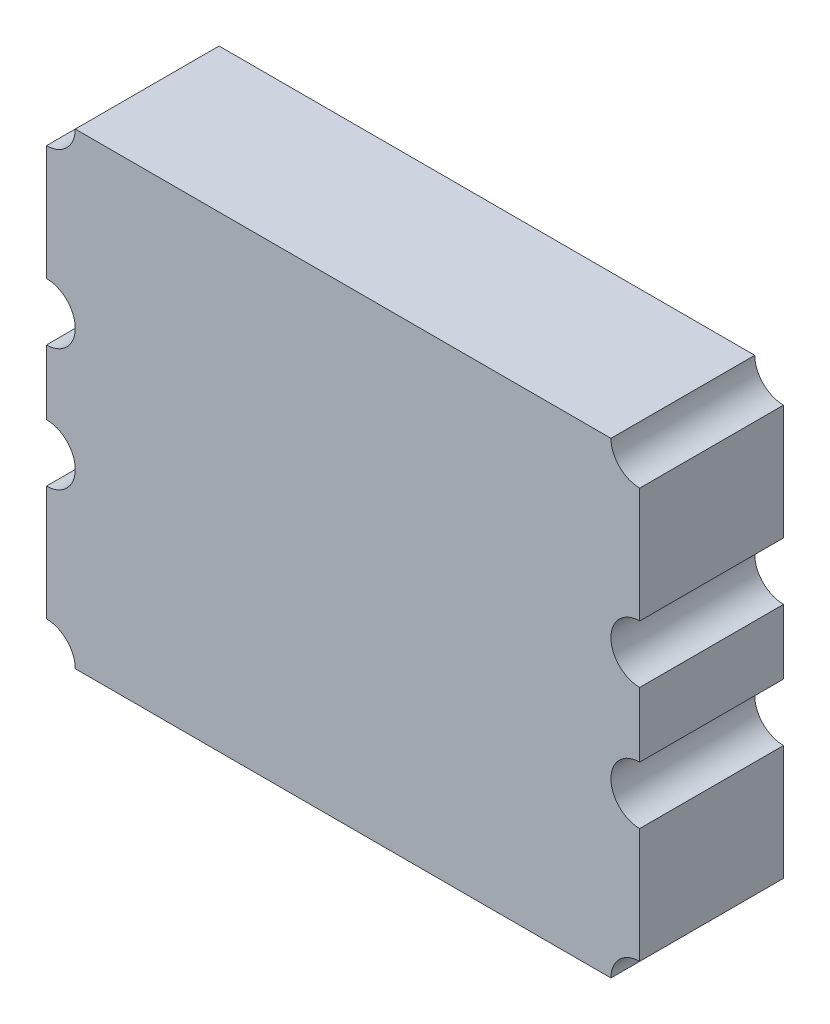
ISO-10303-21;
HEADER;
FILE_DESCRIPTION(('STEP AP214'),'2;1');
FILE_NAME('part.step','',(''),(''),'','','');
FILE_SCHEMA(('AUTOMOTIVE_DESIGN { 1 0 10303 214 1 1 1 1 }'));
ENDSEC;
DATA;
#1=APPLICATION_CONTEXT('core data for automotive mechanical design processes');
#2=APPLICATION_PROTOCOL_DEFINITION('international standard','automotive_design',2000,#1);
#3=PRODUCT_CONTEXT('',#1,'mechanical');
#4=PRODUCT('Part','Part','',(#3));
#5=PRODUCT_RELATED_PRODUCT_CATEGORY('part','',(#4));
#6=PRODUCT_DEFINITION_FORMATION('','',#4);
#7=PRODUCT_DEFINITION_CONTEXT('part definition',#1,'design');
#8=PRODUCT_DEFINITION('design','',#6,#7);
#9=PRODUCT_DEFINITION_SHAPE('','',#8);
#10=(LENGTH_UNIT() NAMED_UNIT(*) SI_UNIT(.MILLI.,.METRE.));
#11=(NAMED_UNIT(*) PLANE_ANGLE_UNIT() SI_UNIT($,.RADIAN.));
#12=(NAMED_UNIT(*) SI_UNIT($,.STERADIAN.) SOLID_ANGLE_UNIT());
#13=UNCERTAINTY_MEASURE_WITH_UNIT(LENGTH_MEASURE(1.E-05),#10,'distance_accuracy_value','');
#14=(GEOMETRIC_REPRESENTATION_CONTEXT(3) GLOBAL_UNCERTAINTY_ASSIGNED_CONTEXT((#13)) GLOBAL_UNIT_ASSIGNED_CONTEXT((#10,
#11,#12)) REPRESENTATION_CONTEXT('',''));
#15=CARTESIAN_POINT('',(0.,0.,0.));
#16=DIRECTION('',(0.,0.,1.));
#17=DIRECTION('',(1.,0.,0.));
#18=AXIS2_PLACEMENT_3D('',#15,#16,#17);
#19=CARTESIAN_POINT('',(-1.49,1.3,0.820000011921));
#20=DIRECTION('',(0.,0.,1.));
#21=DIRECTION('',(1.,0.,0.));
#22=AXIS2_PLACEMENT_3D('',#19,#20,#21);
#23=PLANE('',#22);
#24=CARTESIAN_POINT('',(1.65,0.34,0.820000011921));
#25=DIRECTION('',(0.,0.,-1.));
#26=DIRECTION('',(-1.,0.,0.));
#27=AXIS2_PLACEMENT_3D('',#24,#25,#26);
#28=CIRCLE('',#27,0.16);
#29=CARTESIAN_POINT('',(1.65,0.18,0.820000011921));
#30=VERTEX_POINT('',#29);
#31=CARTESIAN_POINT('',(1.65,0.5,0.820000011921));
#32=VERTEX_POINT('',#31);
#33=EDGE_CURVE('E131',#30,#32,#28,.T.);
#34=ORIENTED_EDGE('',*,*,#33,.T.);
#35=DIRECTION('',(0.,1.,0.));
#36=VECTOR('',#35,1.);
#37=CARTESIAN_POINT('',(1.65,1.3,0.820000011921));
#38=LINE('',#37,#36);
#39=CARTESIAN_POINT('',(1.65,1.14,0.820000011921));
#40=VERTEX_POINT('',#39);
#41=EDGE_CURVE('E127',#32,#40,#38,.T.);
#42=ORIENTED_EDGE('',*,*,#41,.T.);
#43=CARTESIAN_POINT('',(1.65,1.3,0.820000011921));
#44=DIRECTION('',(0.,0.,-1.));
#45=DIRECTION('',(-1.,0.,0.));
#46=AXIS2_PLACEMENT_3D('',#43,#44,#45);
#47=CIRCLE('',#46,0.16);
#48=CARTESIAN_POINT('',(1.49,1.3,0.820000011921));
#49=VERTEX_POINT('',#48);
#50=EDGE_CURVE('E20',#40,#49,#47,.T.);
#51=ORIENTED_EDGE('',*,*,#50,.T.);
#52=DIRECTION('',(1.,0.,0.));
#53=VECTOR('',#52,1.);
#54=CARTESIAN_POINT('',(-1.49,1.3,0.820000011921));
#55=LINE('',#54,#53);
#56=CARTESIAN_POINT('',(-1.49,1.3,0.820000011921));
#57=VERTEX_POINT('',#56);
#58=EDGE_CURVE('E135',#57,#49,#55,.T.);
#59=ORIENTED_EDGE('',*,*,#58,.F.);
#60=CARTESIAN_POINT('',(-1.65,1.3,0.820000011921));
#61=DIRECTION('',(0.,0.,-1.));
#62=DIRECTION('',(-1.,0.,0.));
#63=AXIS2_PLACEMENT_3D('',#60,#61,#62);
#64=CIRCLE('',#63,0.16);
#65=CARTESIAN_POINT('',(-1.65,1.14,0.820000011921));
#66=VERTEX_POINT('',#65);
#67=EDGE_CURVE('E157',#57,#66,#64,.T.);
#68=ORIENTED_EDGE('',*,*,#67,.T.);
#69=DIRECTION('',(0.,1.,0.));
#70=VECTOR('',#69,1.);
#71=CARTESIAN_POINT('',(-1.65,0.5,0.820000011921));
#72=LINE('',#71,#70);
#73=CARTESIAN_POINT('',(-1.65,0.5,0.820000011921));
#74=VERTEX_POINT('',#73);
#75=EDGE_CURVE('E163',#74,#66,#72,.T.);
#76=ORIENTED_EDGE('',*,*,#75,.F.);
#77=CARTESIAN_POINT('',(-1.65,0.34,0.820000011921));
#78=DIRECTION('',(0.,0.,-1.));
#79=DIRECTION('',(-1.,0.,0.));
#80=AXIS2_PLACEMENT_3D('',#77,#78,#79);
#81=CIRCLE('',#80,0.16);
#82=CARTESIAN_POINT('',(-1.65,0.18,0.820000011921));
#83=VERTEX_POINT('',#82);
#84=EDGE_CURVE('E160',#74,#83,#81,.T.);
#85=ORIENTED_EDGE('',*,*,#84,.T.);
#86=DIRECTION('',(0.,1.,0.));
#87=VECTOR('',#86,1.);
#88=CARTESIAN_POINT('',(-1.65,-0.18,0.820000011921));
#89=LINE('',#88,#87);
#90=CARTESIAN_POINT('',(-1.65,-0.18,0.820000011921));
#91=VERTEX_POINT('',#90);
#92=EDGE_CURVE('E167',#91,#83,#89,.T.);
#93=ORIENTED_EDGE('',*,*,#92,.F.);
#94=CARTESIAN_POINT('',(-1.65,-0.34,0.820000011921));
#95=DIRECTION('',(0.,0.,-1.));
#96=DIRECTION('',(-1.,0.,0.));
#97=AXIS2_PLACEMENT_3D('',#94,#95,#96);
#98=CIRCLE('',#97,0.16);
#99=CARTESIAN_POINT('',(-1.65,-0.5,0.820000011921));
#100=VERTEX_POINT('',#99);
#101=EDGE_CURVE('E164',#91,#100,#98,.T.);
#102=ORIENTED_EDGE('',*,*,#101,.T.);
#103=DIRECTION('',(0.,1.,0.));
#104=VECTOR('',#103,1.);
#105=CARTESIAN_POINT('',(-1.65,-1.14,0.820000011921));
#106=LINE('',#105,#104);
#107=CARTESIAN_POINT('',(-1.65,-1.14,0.820000011921));
#108=VERTEX_POINT('',#107);
#109=EDGE_CURVE('E171',#108,#100,#106,.T.);
#110=ORIENTED_EDGE('',*,*,#109,.F.);
#111=CARTESIAN_POINT('',(-1.65,-1.3,0.820000011921));
#112=DIRECTION('',(0.,0.,-1.));
#113=DIRECTION('',(-1.,0.,0.));
#114=AXIS2_PLACEMENT_3D('',#111,#112,#113);
#115=CIRCLE('',#114,0.16);
#116=CARTESIAN_POINT('',(-1.49,-1.3,0.820000011921));
#117=VERTEX_POINT('',#116);
#118=EDGE_CURVE('E168',#108,#117,#115,.T.);
#119=ORIENTED_EDGE('',*,*,#118,.T.);
#120=DIRECTION('',(1.,0.,0.));
#121=VECTOR('',#120,1.);
#122=CARTESIAN_POINT('',(1.49,-1.3,0.820000011921));
#123=LINE('',#122,#121);
#124=CARTESIAN_POINT('',(1.49,-1.3,0.820000011921));
#125=VERTEX_POINT('',#124);
#126=EDGE_CURVE('E207',#125,#117,#123,.F.);
#127=ORIENTED_EDGE('',*,*,#126,.F.);
#128=CARTESIAN_POINT('',(1.65,-1.3,0.820000011921));
#129=DIRECTION('',(0.,0.,-1.));
#130=DIRECTION('',(-1.,0.,0.));
#131=AXIS2_PLACEMENT_3D('',#128,#129,#130);
#132=CIRCLE('',#131,0.16);
#133=CARTESIAN_POINT('',(1.65,-1.14,0.820000011921));
#134=VERTEX_POINT('',#133);
#135=EDGE_CURVE('E146',#125,#134,#132,.T.);
#136=ORIENTED_EDGE('',*,*,#135,.T.);
#137=DIRECTION('',(0.,1.,0.));
#138=VECTOR('',#137,1.);
#139=CARTESIAN_POINT('',(1.65,1.3,0.820000011921));
#140=LINE('',#139,#138);
#141=CARTESIAN_POINT('',(1.65,-0.5,0.820000011921));
#142=VERTEX_POINT('',#141);
#143=EDGE_CURVE('E147',#134,#142,#140,.T.);
#144=ORIENTED_EDGE('',*,*,#143,.T.);
#145=CARTESIAN_POINT('',(1.65,-0.34,0.820000011921));
#146=DIRECTION('',(0.,0.,-1.));
#147=DIRECTION('',(-1.,0.,0.));
#148=AXIS2_PLACEMENT_3D('',#145,#146,#147);
#149=CIRCLE('',#148,0.16);
#150=CARTESIAN_POINT('',(1.65,-0.18,0.820000011921));
#151=VERTEX_POINT('',#150);
#152=EDGE_CURVE('E151',#142,#151,#149,.T.);
#153=ORIENTED_EDGE('',*,*,#152,.T.);
#154=DIRECTION('',(0.,1.,0.));
#155=VECTOR('',#154,1.);
#156=CARTESIAN_POINT('',(1.65,1.3,0.820000011921));
#157=LINE('',#156,#155);
#158=EDGE_CURVE('E155',#151,#30,#157,.T.);
#159=ORIENTED_EDGE('',*,*,#158,.T.);
#160=EDGE_LOOP('',(#34,#42,#51,#59,#68,#76,#85,#93,#102,#110,#119,#127,#136,#144,#153,#159));
#161=FACE_BOUND('',#160,.T.);
#162=ADVANCED_FACE('F17',(#161),#23,.T.);
#163=CARTESIAN_POINT('',(-1.49,1.3,0.02));
#164=DIRECTION('',(0.,1.,0.));
#165=DIRECTION('',(0.,0.,1.));
#166=AXIS2_PLACEMENT_3D('',#163,#164,#165);
#167=PLANE('',#166);
#168=DIRECTION('',(0.,0.,-1.));
#169=VECTOR('',#168,1.);
#170=CARTESIAN_POINT('',(-1.49,1.3,0.02));
#171=LINE('',#170,#169);
#172=CARTESIAN_POINT('',(-1.49,1.3,0.02));
#173=VERTEX_POINT('',#172);
#174=EDGE_CURVE('E159',#173,#57,#171,.F.);
#175=ORIENTED_EDGE('',*,*,#174,.T.);
#176=ORIENTED_EDGE('',*,*,#58,.T.);
#177=DIRECTION('',(0.,0.,-1.));
#178=VECTOR('',#177,1.);
#179=CARTESIAN_POINT('',(1.49,1.3,0.02));
#180=LINE('',#179,#178);
#181=CARTESIAN_POINT('',(1.49,1.3,0.02));
#182=VERTEX_POINT('',#181);
#183=EDGE_CURVE('E141',#49,#182,#180,.T.);
#184=ORIENTED_EDGE('',*,*,#183,.T.);
#185=DIRECTION('',(1.,0.,0.));
#186=VECTOR('',#185,1.);
#187=CARTESIAN_POINT('',(-1.49,1.3,0.02));
#188=LINE('',#187,#186);
#189=EDGE_CURVE('E140',#182,#173,#188,.F.);
#190=ORIENTED_EDGE('',*,*,#189,.T.);
#191=EDGE_LOOP('',(#175,#176,#184,#190));
#192=FACE_BOUND('',#191,.T.);
#193=ADVANCED_FACE('F307',(#192),#167,.T.);
#194=CARTESIAN_POINT('',(-1.65,1.3,0.02));
#195=DIRECTION('',(0.,0.,-1.));
#196=DIRECTION('',(-1.,0.,0.));
#197=AXIS2_PLACEMENT_3D('',#194,#195,#196);
#198=CYLINDRICAL_SURFACE('',#197,0.16);
#199=CARTESIAN_POINT('',(-1.65,1.3,0.02));
#200=DIRECTION('',(0.,0.,-1.));
#201=DIRECTION('',(-1.,0.,0.));
#202=AXIS2_PLACEMENT_3D('',#199,#200,#201);
#203=CIRCLE('',#202,0.16);
#204=CARTESIAN_POINT('',(-1.65,1.14,0.02));
#205=VERTEX_POINT('',#204);
#206=EDGE_CURVE('E172',#173,#205,#203,.T.);
#207=ORIENTED_EDGE('',*,*,#206,.T.);
#208=DIRECTION('',(0.,0.,1.));
#209=VECTOR('',#208,1.);
#210=CARTESIAN_POINT('',(-1.65,1.14,0.02));
#211=LINE('',#210,#209);
#212=EDGE_CURVE('E199',#66,#205,#211,.F.);
#213=ORIENTED_EDGE('',*,*,#212,.F.);
#214=ORIENTED_EDGE('',*,*,#67,.F.);
#215=ORIENTED_EDGE('',*,*,#174,.F.);
#216=EDGE_LOOP('',(#207,#213,#214,#215));
#217=FACE_BOUND('',#216,.T.);
#218=ADVANCED_FACE('F305',(#217),#198,.F.);
#219=CARTESIAN_POINT('',(-1.65,0.5,0.02));
#220=DIRECTION('',(-1.,0.,0.));
#221=DIRECTION('',(0.,0.,1.));
#222=AXIS2_PLACEMENT_3D('',#219,#220,#221);
#223=PLANE('',#222);
#224=DIRECTION('',(0.,0.,-1.));
#225=VECTOR('',#224,1.);
#226=CARTESIAN_POINT('',(-1.65,0.5,0.02));
#227=LINE('',#226,#225);
#228=CARTESIAN_POINT('',(-1.65,0.5,0.02));
#229=VERTEX_POINT('',#228);
#230=EDGE_CURVE('E162',#229,#74,#227,.F.);
#231=ORIENTED_EDGE('',*,*,#230,.T.);
#232=ORIENTED_EDGE('',*,*,#75,.T.);
#233=ORIENTED_EDGE('',*,*,#212,.T.);
#234=DIRECTION('',(0.,1.,0.));
#235=VECTOR('',#234,1.);
#236=CARTESIAN_POINT('',(-1.65,1.3,0.02));
#237=LINE('',#236,#235);
#238=EDGE_CURVE('E175',#205,#229,#237,.F.);
#239=ORIENTED_EDGE('',*,*,#238,.T.);
#240=EDGE_LOOP('',(#231,#232,#233,#239));
#241=FACE_BOUND('',#240,.T.);
#242=ADVANCED_FACE('F301',(#241),#223,.T.);
#243=CARTESIAN_POINT('',(-1.65,0.34,0.02));
#244=DIRECTION('',(0.,0.,-1.));
#245=DIRECTION('',(-1.,0.,0.));
#246=AXIS2_PLACEMENT_3D('',#243,#244,#245);
#247=CYLINDRICAL_SURFACE('',#246,0.16);
#248=CARTESIAN_POINT('',(-1.65,0.34,0.02));
#249=DIRECTION('',(0.,0.,-1.));
#250=DIRECTION('',(-1.,0.,0.));
#251=AXIS2_PLACEMENT_3D('',#248,#249,#250);
#252=CIRCLE('',#251,0.16);
#253=CARTESIAN_POINT('',(-1.65,0.18,0.02));
#254=VERTEX_POINT('',#253);
#255=EDGE_CURVE('E176',#229,#254,#252,.T.);
#256=ORIENTED_EDGE('',*,*,#255,.T.);
#257=DIRECTION('',(0.,0.,1.));
#258=VECTOR('',#257,1.);
#259=CARTESIAN_POINT('',(-1.65,0.18,0.02));
#260=LINE('',#259,#258);
#261=EDGE_CURVE('E202',#83,#254,#260,.F.);
#262=ORIENTED_EDGE('',*,*,#261,.F.);
#263=ORIENTED_EDGE('',*,*,#84,.F.);
#264=ORIENTED_EDGE('',*,*,#230,.F.);
#265=EDGE_LOOP('',(#256,#262,#263,#264));
#266=FACE_BOUND('',#265,.T.);
#267=ADVANCED_FACE('F298',(#266),#247,.F.);
#268=CARTESIAN_POINT('',(-1.65,-0.18,0.02));
#269=DIRECTION('',(-1.,0.,0.));
#270=DIRECTION('',(0.,0.,1.));
#271=AXIS2_PLACEMENT_3D('',#268,#269,#270);
#272=PLANE('',#271);
#273=DIRECTION('',(0.,0.,-1.));
#274=VECTOR('',#273,1.);
#275=CARTESIAN_POINT('',(-1.65,-0.18,0.02));
#276=LINE('',#275,#274);
#277=CARTESIAN_POINT('',(-1.65,-0.18,0.02));
#278=VERTEX_POINT('',#277);
#279=EDGE_CURVE('E166',#278,#91,#276,.F.);
#280=ORIENTED_EDGE('',*,*,#279,.T.);
#281=ORIENTED_EDGE('',*,*,#92,.T.);
#282=ORIENTED_EDGE('',*,*,#261,.T.);
#283=DIRECTION('',(0.,1.,0.));
#284=VECTOR('',#283,1.);
#285=CARTESIAN_POINT('',(-1.65,1.3,0.02));
#286=LINE('',#285,#284);
#287=EDGE_CURVE('E179',#254,#278,#286,.F.);
#288=ORIENTED_EDGE('',*,*,#287,.T.);
#289=EDGE_LOOP('',(#280,#281,#282,#288));
#290=FACE_BOUND('',#289,.T.);
#291=ADVANCED_FACE('F293',(#290),#272,.T.);
#292=CARTESIAN_POINT('',(-1.65,-0.34,0.02));
#293=DIRECTION('',(0.,0.,-1.));
#294=DIRECTION('',(-1.,0.,0.));
#295=AXIS2_PLACEMENT_3D('',#292,#293,#294);
#296=CYLINDRICAL_SURFACE('',#295,0.16);
#297=CARTESIAN_POINT('',(-1.65,-0.34,0.02));
#298=DIRECTION('',(0.,0.,-1.));
#299=DIRECTION('',(-1.,0.,0.));
#300=AXIS2_PLACEMENT_3D('',#297,#298,#299);
#301=CIRCLE('',#300,0.16);
#302=CARTESIAN_POINT('',(-1.65,-0.5,0.02));
#303=VERTEX_POINT('',#302);
#304=EDGE_CURVE('E180',#278,#303,#301,.T.);
#305=ORIENTED_EDGE('',*,*,#304,.T.);
#306=DIRECTION('',(0.,0.,1.));
#307=VECTOR('',#306,1.);
#308=CARTESIAN_POINT('',(-1.65,-0.5,0.02));
#309=LINE('',#308,#307);
#310=EDGE_CURVE('E204',#100,#303,#309,.F.);
#311=ORIENTED_EDGE('',*,*,#310,.F.);
#312=ORIENTED_EDGE('',*,*,#101,.F.);
#313=ORIENTED_EDGE('',*,*,#279,.F.);
#314=EDGE_LOOP('',(#305,#311,#312,#313));
#315=FACE_BOUND('',#314,.T.);
#316=ADVANCED_FACE('F290',(#315),#296,.F.);
#317=CARTESIAN_POINT('',(-1.65,-1.14,0.02));
#318=DIRECTION('',(-1.,0.,0.));
#319=DIRECTION('',(0.,0.,1.));
#320=AXIS2_PLACEMENT_3D('',#317,#318,#319);
#321=PLANE('',#320);
#322=DIRECTION('',(0.,0.,-1.));
#323=VECTOR('',#322,1.);
#324=CARTESIAN_POINT('',(-1.65,-1.14,0.02));
#325=LINE('',#324,#323);
#326=CARTESIAN_POINT('',(-1.65,-1.14,0.02));
#327=VERTEX_POINT('',#326);
#328=EDGE_CURVE('E170',#327,#108,#325,.F.);
#329=ORIENTED_EDGE('',*,*,#328,.T.);
#330=ORIENTED_EDGE('',*,*,#109,.T.);
#331=ORIENTED_EDGE('',*,*,#310,.T.);
#332=DIRECTION('',(0.,1.,0.));
#333=VECTOR('',#332,1.);
#334=CARTESIAN_POINT('',(-1.65,1.3,0.02));
#335=LINE('',#334,#333);
#336=EDGE_CURVE('E183',#303,#327,#335,.F.);
#337=ORIENTED_EDGE('',*,*,#336,.T.);
#338=EDGE_LOOP('',(#329,#330,#331,#337));
#339=FACE_BOUND('',#338,.T.);
#340=ADVANCED_FACE('F285',(#339),#321,.T.);
#341=CARTESIAN_POINT('',(-1.65,-1.3,0.02));
#342=DIRECTION('',(0.,0.,-1.));
#343=DIRECTION('',(-1.,0.,0.));
#344=AXIS2_PLACEMENT_3D('',#341,#342,#343);
#345=CYLINDRICAL_SURFACE('',#344,0.16);
#346=CARTESIAN_POINT('',(-1.65,-1.3,0.02));
#347=DIRECTION('',(0.,0.,-1.));
#348=DIRECTION('',(-1.,0.,0.));
#349=AXIS2_PLACEMENT_3D('',#346,#347,#348);
#350=CIRCLE('',#349,0.16);
#351=CARTESIAN_POINT('',(-1.49,-1.3,0.02));
#352=VERTEX_POINT('',#351);
#353=EDGE_CURVE('E184',#327,#352,#350,.T.);
#354=ORIENTED_EDGE('',*,*,#353,.T.);
#355=DIRECTION('',(0.,0.,-1.));
#356=VECTOR('',#355,1.);
#357=CARTESIAN_POINT('',(-1.49,-1.3,0.02));
#358=LINE('',#357,#356);
#359=EDGE_CURVE('E211',#117,#352,#358,.T.);
#360=ORIENTED_EDGE('',*,*,#359,.F.);
#361=ORIENTED_EDGE('',*,*,#118,.F.);
#362=ORIENTED_EDGE('',*,*,#328,.F.);
#363=EDGE_LOOP('',(#354,#360,#361,#362));
#364=FACE_BOUND('',#363,.T.);
#365=ADVANCED_FACE('F282',(#364),#345,.F.);
#366=CARTESIAN_POINT('',(1.49,-1.3,0.02));
#367=DIRECTION('',(0.,-1.,0.));
#368=DIRECTION('',(0.,0.,-1.));
#369=AXIS2_PLACEMENT_3D('',#366,#367,#368);
#370=PLANE('',#369);
#371=DIRECTION('',(0.,0.,-1.));
#372=VECTOR('',#371,1.);
#373=CARTESIAN_POINT('',(1.49,-1.3,0.02));
#374=LINE('',#373,#372);
#375=CARTESIAN_POINT('',(1.49,-1.3,0.02));
#376=VERTEX_POINT('',#375);
#377=EDGE_CURVE('E210',#376,#125,#374,.F.);
#378=ORIENTED_EDGE('',*,*,#377,.T.);
#379=ORIENTED_EDGE('',*,*,#126,.T.);
#380=ORIENTED_EDGE('',*,*,#359,.T.);
#381=DIRECTION('',(1.,0.,0.));
#382=VECTOR('',#381,1.);
#383=CARTESIAN_POINT('',(-1.49,-1.3,0.02));
#384=LINE('',#383,#382);
#385=EDGE_CURVE('E187',#352,#376,#384,.T.);
#386=ORIENTED_EDGE('',*,*,#385,.T.);
#387=EDGE_LOOP('',(#378,#379,#380,#386));
#388=FACE_BOUND('',#387,.T.);
#389=ADVANCED_FACE('F277',(#388),#370,.T.);
#390=CARTESIAN_POINT('',(1.65,-1.3,0.02));
#391=DIRECTION('',(0.,0.,-1.));
#392=DIRECTION('',(-1.,0.,0.));
#393=AXIS2_PLACEMENT_3D('',#390,#391,#392);
#394=CYLINDRICAL_SURFACE('',#393,0.16);
#395=CARTESIAN_POINT('',(1.65,-1.3,0.02));
#396=DIRECTION('',(0.,0.,-1.));
#397=DIRECTION('',(-1.,0.,0.));
#398=AXIS2_PLACEMENT_3D('',#395,#396,#397);
#399=CIRCLE('',#398,0.16);
#400=CARTESIAN_POINT('',(1.65,-1.14,0.02));
#401=VERTEX_POINT('',#400);
#402=EDGE_CURVE('E188',#376,#401,#399,.T.);
#403=ORIENTED_EDGE('',*,*,#402,.T.);
#404=DIRECTION('',(0.,0.,-1.));
#405=VECTOR('',#404,1.);
#406=CARTESIAN_POINT('',(1.65,-1.14,0.02));
#407=LINE('',#406,#405);
#408=EDGE_CURVE('E227',#134,#401,#407,.T.);
#409=ORIENTED_EDGE('',*,*,#408,.F.);
#410=ORIENTED_EDGE('',*,*,#135,.F.);
#411=ORIENTED_EDGE('',*,*,#377,.F.);
#412=EDGE_LOOP('',(#403,#409,#410,#411));
#413=FACE_BOUND('',#412,.T.);
#414=ADVANCED_FACE('F275',(#413),#394,.F.);
#415=CARTESIAN_POINT('',(1.65,-0.5,0.02));
#416=DIRECTION('',(1.,0.,0.));
#417=DIRECTION('',(0.,0.,-1.));
#418=AXIS2_PLACEMENT_3D('',#415,#416,#417);
#419=PLANE('',#418);
#420=DIRECTION('',(0.,0.,-1.));
#421=VECTOR('',#420,1.);
#422=CARTESIAN_POINT('',(1.65,-0.5,0.02));
#423=LINE('',#422,#421);
#424=CARTESIAN_POINT('',(1.65,-0.5,0.02));
#425=VERTEX_POINT('',#424);
#426=EDGE_CURVE('E229',#425,#142,#423,.F.);
#427=ORIENTED_EDGE('',*,*,#426,.T.);
#428=ORIENTED_EDGE('',*,*,#143,.F.);
#429=ORIENTED_EDGE('',*,*,#408,.T.);
#430=DIRECTION('',(0.,1.,0.));
#431=VECTOR('',#430,1.);
#432=CARTESIAN_POINT('',(1.65,1.3,0.02));
#433=LINE('',#432,#431);
#434=EDGE_CURVE('E191',#401,#425,#433,.T.);
#435=ORIENTED_EDGE('',*,*,#434,.T.);
#436=EDGE_LOOP('',(#427,#428,#429,#435));
#437=FACE_BOUND('',#436,.T.);
#438=ADVANCED_FACE('F271',(#437),#419,.T.);
#439=CARTESIAN_POINT('',(1.65,-0.34,0.02));
#440=DIRECTION('',(0.,0.,-1.));
#441=DIRECTION('',(-1.,0.,0.));
#442=AXIS2_PLACEMENT_3D('',#439,#440,#441);
#443=CYLINDRICAL_SURFACE('',#442,0.16);
#444=CARTESIAN_POINT('',(1.65,-0.34,0.02));
#445=DIRECTION('',(0.,0.,-1.));
#446=DIRECTION('',(-1.,0.,0.));
#447=AXIS2_PLACEMENT_3D('',#444,#445,#446);
#448=CIRCLE('',#447,0.16);
#449=CARTESIAN_POINT('',(1.65,-0.18,0.02));
#450=VERTEX_POINT('',#449);
#451=EDGE_CURVE('E192',#425,#450,#448,.T.);
#452=ORIENTED_EDGE('',*,*,#451,.T.);
#453=DIRECTION('',(0.,0.,-1.));
#454=VECTOR('',#453,1.);
#455=CARTESIAN_POINT('',(1.65,-0.18,0.02));
#456=LINE('',#455,#454);
#457=EDGE_CURVE('E232',#151,#450,#456,.T.);
#458=ORIENTED_EDGE('',*,*,#457,.F.);
#459=ORIENTED_EDGE('',*,*,#152,.F.);
#460=ORIENTED_EDGE('',*,*,#426,.F.);
#461=EDGE_LOOP('',(#452,#458,#459,#460));
#462=FACE_BOUND('',#461,.T.);
#463=ADVANCED_FACE('F269',(#462),#443,.F.);
#464=CARTESIAN_POINT('',(1.65,0.18,0.02));
#465=DIRECTION('',(1.,0.,0.));
#466=DIRECTION('',(0.,0.,-1.));
#467=AXIS2_PLACEMENT_3D('',#464,#465,#466);
#468=PLANE('',#467);
#469=DIRECTION('',(0.,0.,-1.));
#470=VECTOR('',#469,1.);
#471=CARTESIAN_POINT('',(1.65,0.18,0.02));
#472=LINE('',#471,#470);
#473=CARTESIAN_POINT('',(1.65,0.18,0.02));
#474=VERTEX_POINT('',#473);
#475=EDGE_CURVE('E235',#474,#30,#472,.F.);
#476=ORIENTED_EDGE('',*,*,#475,.T.);
#477=ORIENTED_EDGE('',*,*,#158,.F.);
#478=ORIENTED_EDGE('',*,*,#457,.T.);
#479=DIRECTION('',(0.,1.,0.));
#480=VECTOR('',#479,1.);
#481=CARTESIAN_POINT('',(1.65,1.3,0.02));
#482=LINE('',#481,#480);
#483=EDGE_CURVE('E194',#450,#474,#482,.T.);
#484=ORIENTED_EDGE('',*,*,#483,.T.);
#485=EDGE_LOOP('',(#476,#477,#478,#484));
#486=FACE_BOUND('',#485,.T.);
#487=ADVANCED_FACE('F257',(#486),#468,.T.);
#488=CARTESIAN_POINT('',(1.65,0.34,0.02));
#489=DIRECTION('',(0.,0.,-1.));
#490=DIRECTION('',(-1.,0.,0.));
#491=AXIS2_PLACEMENT_3D('',#488,#489,#490);
#492=CYLINDRICAL_SURFACE('',#491,0.16);
#493=CARTESIAN_POINT('',(1.65,0.34,0.02));
#494=DIRECTION('',(0.,0.,-1.));
#495=DIRECTION('',(-1.,0.,0.));
#496=AXIS2_PLACEMENT_3D('',#493,#494,#495);
#497=CIRCLE('',#496,0.16);
#498=CARTESIAN_POINT('',(1.65,0.5,0.02));
#499=VERTEX_POINT('',#498);
#500=EDGE_CURVE('E195',#474,#499,#497,.T.);
#501=ORIENTED_EDGE('',*,*,#500,.T.);
#502=DIRECTION('',(0.,0.,-1.));
#503=VECTOR('',#502,1.);
#504=CARTESIAN_POINT('',(1.65,0.5,0.02));
#505=LINE('',#504,#503);
#506=EDGE_CURVE('E238',#32,#499,#505,.T.);
#507=ORIENTED_EDGE('',*,*,#506,.F.);
#508=ORIENTED_EDGE('',*,*,#33,.F.);
#509=ORIENTED_EDGE('',*,*,#475,.F.);
#510=EDGE_LOOP('',(#501,#507,#508,#509));
#511=FACE_BOUND('',#510,.T.);
#512=ADVANCED_FACE('F266',(#511),#492,.F.);
#513=CARTESIAN_POINT('',(1.65,1.14,0.02));
#514=DIRECTION('',(1.,0.,0.));
#515=DIRECTION('',(0.,0.,-1.));
#516=AXIS2_PLACEMENT_3D('',#513,#514,#515);
#517=PLANE('',#516);
#518=DIRECTION('',(0.,0.,-1.));
#519=VECTOR('',#518,1.);
#520=CARTESIAN_POINT('',(1.65,1.14,0.02));
#521=LINE('',#520,#519);
#522=CARTESIAN_POINT('',(1.65,1.14,0.02));
#523=VERTEX_POINT('',#522);
#524=EDGE_CURVE('E34',#523,#40,#521,.F.);
#525=ORIENTED_EDGE('',*,*,#524,.T.);
#526=ORIENTED_EDGE('',*,*,#41,.F.);
#527=ORIENTED_EDGE('',*,*,#506,.T.);
#528=DIRECTION('',(0.,1.,0.));
#529=VECTOR('',#528,1.);
#530=CARTESIAN_POINT('',(1.65,1.3,0.02));
#531=LINE('',#530,#529);
#532=EDGE_CURVE('E26',#499,#523,#531,.T.);
#533=ORIENTED_EDGE('',*,*,#532,.T.);
#534=EDGE_LOOP('',(#525,#526,#527,#533));
#535=FACE_BOUND('',#534,.T.);
#536=ADVANCED_FACE('F138',(#535),#517,.T.);
#537=CARTESIAN_POINT('',(1.65,1.3,0.02));
#538=DIRECTION('',(0.,0.,-1.));
#539=DIRECTION('',(-1.,0.,0.));
#540=AXIS2_PLACEMENT_3D('',#537,#538,#539);
#541=CYLINDRICAL_SURFACE('',#540,0.16);
#542=CARTESIAN_POINT('',(1.65,1.3,0.02));
#543=DIRECTION('',(0.,0.,-1.));
#544=DIRECTION('',(-1.,0.,0.));
#545=AXIS2_PLACEMENT_3D('',#542,#543,#544);
#546=CIRCLE('',#545,0.16);
#547=EDGE_CURVE('E11',#523,#182,#546,.T.);
#548=ORIENTED_EDGE('',*,*,#547,.T.);
#549=ORIENTED_EDGE('',*,*,#183,.F.);
#550=ORIENTED_EDGE('',*,*,#50,.F.);
#551=ORIENTED_EDGE('',*,*,#524,.F.);
#552=EDGE_LOOP('',(#548,#549,#550,#551));
#553=FACE_BOUND('',#552,.T.);
#554=ADVANCED_FACE('F144',(#553),#541,.F.);
#555=CARTESIAN_POINT('',(-1.49,1.3,0.02));
#556=DIRECTION('',(0.,0.,1.));
#557=DIRECTION('',(1.,0.,0.));
#558=AXIS2_PLACEMENT_3D('',#555,#556,#557);
#559=PLANE('',#558);
#560=ORIENTED_EDGE('',*,*,#532,.F.);
#561=ORIENTED_EDGE('',*,*,#500,.F.);
#562=ORIENTED_EDGE('',*,*,#483,.F.);
#563=ORIENTED_EDGE('',*,*,#451,.F.);
#564=ORIENTED_EDGE('',*,*,#434,.F.);
#565=ORIENTED_EDGE('',*,*,#402,.F.);
#566=ORIENTED_EDGE('',*,*,#385,.F.);
#567=ORIENTED_EDGE('',*,*,#353,.F.);
#568=ORIENTED_EDGE('',*,*,#336,.F.);
#569=ORIENTED_EDGE('',*,*,#304,.F.);
#570=ORIENTED_EDGE('',*,*,#287,.F.);
#571=ORIENTED_EDGE('',*,*,#255,.F.);
#572=ORIENTED_EDGE('',*,*,#238,.F.);
#573=ORIENTED_EDGE('',*,*,#206,.F.);
#574=ORIENTED_EDGE('',*,*,#189,.F.);
#575=ORIENTED_EDGE('',*,*,#547,.F.);
#576=EDGE_LOOP('',(#560,#561,#562,#563,#564,#565,#566,#567,#568,#569,#570,#571,#572,#573,#574,#575));
#577=FACE_BOUND('',#576,.T.);
#578=ADVANCED_FACE('F263',(#577),#559,.F.);
#579=CLOSED_SHELL('',(#162,#193,#218,#242,#267,#291,#316,#340,#365,#389,#414,#438,#463,#487,
#512,#536,#554,#578));
#580=MANIFOLD_SOLID_BREP('B1',#579);
#581=ADVANCED_BREP_SHAPE_REPRESENTATION('',(#18,#580),#14);
#582=SHAPE_DEFINITION_REPRESENTATION(#9,#581);
ENDSEC;
END-ISO-10303-21;
